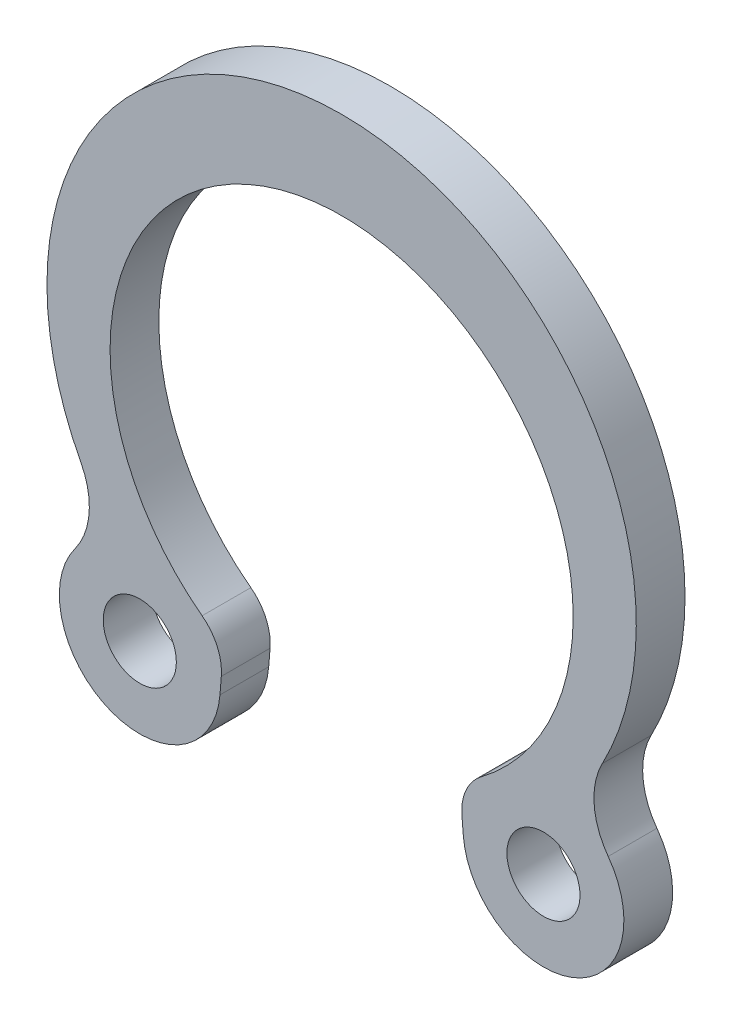
ISO-10303-21;
HEADER;
FILE_DESCRIPTION(('STEP AP214'),'2;1');
FILE_NAME('part.step','',(''),(''),'','','');
FILE_SCHEMA(('AUTOMOTIVE_DESIGN { 1 0 10303 214 1 1 1 1 }'));
ENDSEC;
DATA;
#1=APPLICATION_CONTEXT('core data for automotive mechanical design processes');
#2=APPLICATION_PROTOCOL_DEFINITION('international standard','automotive_design',2000,#1);
#3=PRODUCT_CONTEXT('',#1,'mechanical');
#4=PRODUCT('Part','Part','',(#3));
#5=PRODUCT_RELATED_PRODUCT_CATEGORY('part','',(#4));
#6=PRODUCT_DEFINITION_FORMATION('','',#4);
#7=PRODUCT_DEFINITION_CONTEXT('part definition',#1,'design');
#8=PRODUCT_DEFINITION('design','',#6,#7);
#9=PRODUCT_DEFINITION_SHAPE('','',#8);
#10=(LENGTH_UNIT() NAMED_UNIT(*) SI_UNIT(.MILLI.,.METRE.));
#11=(NAMED_UNIT(*) PLANE_ANGLE_UNIT() SI_UNIT($,.RADIAN.));
#12=(NAMED_UNIT(*) SI_UNIT($,.STERADIAN.) SOLID_ANGLE_UNIT());
#13=UNCERTAINTY_MEASURE_WITH_UNIT(LENGTH_MEASURE(1.E-05),#10,'distance_accuracy_value','');
#14=(GEOMETRIC_REPRESENTATION_CONTEXT(3) GLOBAL_UNCERTAINTY_ASSIGNED_CONTEXT((#13)) GLOBAL_UNIT_ASSIGNED_CONTEXT((#10,
#11,#12)) REPRESENTATION_CONTEXT('',''));
#15=CARTESIAN_POINT('',(0.,0.,0.));
#16=DIRECTION('',(0.,0.,1.));
#17=DIRECTION('',(1.,0.,0.));
#18=AXIS2_PLACEMENT_3D('',#15,#16,#17);
#19=CARTESIAN_POINT('',(0.,0.,1.));
#20=DIRECTION('',(0.,0.,1.));
#21=DIRECTION('',(1.,0.,0.));
#22=AXIS2_PLACEMENT_3D('',#19,#20,#21);
#23=PLANE('',#22);
#24=CARTESIAN_POINT('',(0.,0.,1.));
#25=DIRECTION('',(0.,0.,-1.));
#26=DIRECTION('',(1.,0.,0.));
#27=AXIS2_PLACEMENT_3D('',#24,#25,#26);
#28=CIRCLE('',#27,4.75);
#29=CARTESIAN_POINT('',(-2.86217284926524,-3.79083982528,1.));
#30=VERTEX_POINT('',#29);
#31=CARTESIAN_POINT('',(2.86217285222121,-3.79083982304818,1.));
#32=VERTEX_POINT('',#31);
#33=EDGE_CURVE('E127',#30,#32,#28,.T.);
#34=ORIENTED_EDGE('',*,*,#33,.T.);
#35=CARTESIAN_POINT('',(3.46473555795199,-4.58891136474253,1.));
#36=DIRECTION('',(0.,0.,-1.));
#37=DIRECTION('',(1.,7.79764165563523E-10,0.));
#38=AXIS2_PLACEMENT_3D('',#35,#36,#37);
#39=CIRCLE('',#38,1.);
#40=CARTESIAN_POINT('',(2.46804304489601,-4.67017657512285,1.));
#41=VERTEX_POINT('',#40);
#42=EDGE_CURVE('E152',#41,#32,#39,.T.);
#43=ORIENTED_EDGE('',*,*,#42,.F.);
#44=DIRECTION('',(-0.081265210380318,0.996692513055979,0.));
#45=VECTOR('',#44,1.);
#46=CARTESIAN_POINT('',(2.46804304489601,-4.67017657512285,1.));
#47=LINE('',#46,#45);
#48=CARTESIAN_POINT('',(2.49606525528703,-5.01386026418612,1.));
#49=VERTEX_POINT('',#48);
#50=EDGE_CURVE('E158',#49,#41,#47,.T.);
#51=ORIENTED_EDGE('',*,*,#50,.F.);
#52=CARTESIAN_POINT('',(4.14063276070596,-4.88007790316594,1.));
#53=DIRECTION('',(0.,0.,-1.));
#54=DIRECTION('',(-1.,-7.79764165563523E-10,0.));
#55=AXIS2_PLACEMENT_3D('',#52,#53,#54);
#56=CIRCLE('',#55,1.65);
#57=CARTESIAN_POINT('',(5.46837810565211,-3.9004900822056,1.));
#58=VERTEX_POINT('',#57);
#59=EDGE_CURVE('E198',#58,#49,#56,.T.);
#60=ORIENTED_EDGE('',*,*,#59,.F.);
#61=CARTESIAN_POINT('',(6.67541932833043,-3.00995569951438,1.));
#62=DIRECTION('',(0.,0.,1.));
#63=DIRECTION('',(-1.,-7.79764165563523E-10,0.));
#64=AXIS2_PLACEMENT_3D('',#61,#62,#63);
#65=CIRCLE('',#64,1.5);
#66=CARTESIAN_POINT('',(5.34821160235626,-2.31101389069588,1.));
#67=VERTEX_POINT('',#66);
#68=EDGE_CURVE('E200',#67,#58,#65,.T.);
#69=ORIENTED_EDGE('',*,*,#68,.F.);
#70=CARTESIAN_POINT('',(0.,0.505492235974415,1.));
#71=DIRECTION('',(0.,0.,1.));
#72=DIRECTION('',(1.,0.,0.));
#73=AXIS2_PLACEMENT_3D('',#70,#71,#72);
#74=CIRCLE('',#73,6.04450776402559);
#75=CARTESIAN_POINT('',(-5.34821160055421,-2.31101389486623,1.));
#76=VERTEX_POINT('',#75);
#77=EDGE_CURVE('E85',#67,#76,#74,.T.);
#78=ORIENTED_EDGE('',*,*,#77,.T.);
#79=CARTESIAN_POINT('',(-6.67541932598337,-3.00995570471963,1.));
#80=DIRECTION('',(0.,0.,-1.));
#81=DIRECTION('',(1.,0.,0.));
#82=AXIS2_PLACEMENT_3D('',#79,#80,#81);
#83=CIRCLE('',#82,1.5);
#84=CARTESIAN_POINT('',(-5.46837810261065,-3.90049008646964,1.));
#85=VERTEX_POINT('',#84);
#86=EDGE_CURVE('E99',#76,#85,#83,.T.);
#87=ORIENTED_EDGE('',*,*,#86,.T.);
#88=CARTESIAN_POINT('',(-4.14063275690066,-4.88007790639466,1.));
#89=DIRECTION('',(0.,0.,1.));
#90=DIRECTION('',(1.,0.,0.));
#91=AXIS2_PLACEMENT_3D('',#88,#89,#90);
#92=CIRCLE('',#91,1.65);
#93=CARTESIAN_POINT('',(-2.4960652513774,-5.01386026613247,1.));
#94=VERTEX_POINT('',#93);
#95=EDGE_CURVE('E93',#85,#94,#92,.T.);
#96=ORIENTED_EDGE('',*,*,#95,.T.);
#97=DIRECTION('',(0.0812652096031329,0.996692513119346,0.));
#98=VECTOR('',#97,1.);
#99=CARTESIAN_POINT('',(-2.46804304125437,-4.67017657704734,1.));
#100=LINE('',#99,#98);
#101=CARTESIAN_POINT('',(-2.46804304125437,-4.67017657704734,1.));
#102=VERTEX_POINT('',#101);
#103=EDGE_CURVE('E97',#94,#102,#100,.T.);
#104=ORIENTED_EDGE('',*,*,#103,.T.);
#105=CARTESIAN_POINT('',(-3.46473555437372,-4.58891136744421,1.));
#106=DIRECTION('',(0.,0.,1.));
#107=DIRECTION('',(-1.,0.,0.));
#108=AXIS2_PLACEMENT_3D('',#105,#106,#107);
#109=CIRCLE('',#108,1.);
#110=EDGE_CURVE('E50',#102,#30,#109,.T.);
#111=ORIENTED_EDGE('',*,*,#110,.T.);
#112=EDGE_LOOP('',(#34,#43,#51,#60,#69,#78,#87,#96,#104,#111));
#113=FACE_BOUND('',#112,.T.);
#114=CARTESIAN_POINT('',(-4.14063275690066,-4.88007790639466,1.));
#115=DIRECTION('',(0.,0.,1.));
#116=DIRECTION('',(1.,0.,0.));
#117=AXIS2_PLACEMENT_3D('',#114,#115,#116);
#118=CIRCLE('',#117,0.750000000000001);
#119=CARTESIAN_POINT('',(-3.39063275690065,-4.88007790639466,1.));
#120=VERTEX_POINT('',#119);
#121=EDGE_CURVE('E120',#120,#120,#118,.T.);
#122=ORIENTED_EDGE('',*,*,#121,.F.);
#123=EDGE_LOOP('',(#122));
#124=FACE_BOUND('',#123,.T.);
#125=CARTESIAN_POINT('',(4.14063276070596,-4.88007790316594,1.));
#126=DIRECTION('',(0.,0.,-1.));
#127=DIRECTION('',(-1.,-7.79764165563523E-10,0.));
#128=AXIS2_PLACEMENT_3D('',#125,#126,#127);
#129=CIRCLE('',#128,0.750000000000001);
#130=CARTESIAN_POINT('',(3.39063276070596,-4.88007790375076,1.));
#131=VERTEX_POINT('',#130);
#132=EDGE_CURVE('E208',#131,#131,#129,.T.);
#133=ORIENTED_EDGE('',*,*,#132,.T.);
#134=EDGE_LOOP('',(#133));
#135=FACE_BOUND('',#134,.T.);
#136=ADVANCED_FACE('F33',(#113,#124,#135),#23,.T.);
#137=CARTESIAN_POINT('',(0.,0.,0.));
#138=DIRECTION('',(0.,0.,1.));
#139=DIRECTION('',(1.,0.,0.));
#140=AXIS2_PLACEMENT_3D('',#137,#138,#139);
#141=PLANE('',#140);
#142=CARTESIAN_POINT('',(0.,0.,0.));
#143=DIRECTION('',(0.,0.,-1.));
#144=DIRECTION('',(1.,0.,0.));
#145=AXIS2_PLACEMENT_3D('',#142,#143,#144);
#146=CIRCLE('',#145,4.75);
#147=CARTESIAN_POINT('',(-2.86217284926524,-3.79083982528,0.));
#148=VERTEX_POINT('',#147);
#149=CARTESIAN_POINT('',(2.86217285222121,-3.79083982304818,0.));
#150=VERTEX_POINT('',#149);
#151=EDGE_CURVE('E116',#148,#150,#146,.T.);
#152=ORIENTED_EDGE('',*,*,#151,.F.);
#153=CARTESIAN_POINT('',(-3.46473555437372,-4.58891136744421,0.));
#154=DIRECTION('',(0.,0.,1.));
#155=DIRECTION('',(-1.,0.,0.));
#156=AXIS2_PLACEMENT_3D('',#153,#154,#155);
#157=CIRCLE('',#156,1.);
#158=CARTESIAN_POINT('',(-2.46804304125437,-4.67017657704734,0.));
#159=VERTEX_POINT('',#158);
#160=EDGE_CURVE('E77',#159,#148,#157,.T.);
#161=ORIENTED_EDGE('',*,*,#160,.F.);
#162=DIRECTION('',(0.0812652096031329,0.996692513119346,0.));
#163=VECTOR('',#162,1.);
#164=CARTESIAN_POINT('',(-2.46804304125437,-4.67017657704734,0.));
#165=LINE('',#164,#163);
#166=CARTESIAN_POINT('',(-2.4960652513774,-5.01386026613247,0.));
#167=VERTEX_POINT('',#166);
#168=EDGE_CURVE('E71',#167,#159,#165,.T.);
#169=ORIENTED_EDGE('',*,*,#168,.F.);
#170=CARTESIAN_POINT('',(-4.14063275690066,-4.88007790639466,0.));
#171=DIRECTION('',(0.,0.,1.));
#172=DIRECTION('',(1.,0.,0.));
#173=AXIS2_PLACEMENT_3D('',#170,#171,#172);
#174=CIRCLE('',#173,1.65);
#175=CARTESIAN_POINT('',(-5.46837810261065,-3.90049008646964,0.));
#176=VERTEX_POINT('',#175);
#177=EDGE_CURVE('E107',#176,#167,#174,.T.);
#178=ORIENTED_EDGE('',*,*,#177,.F.);
#179=CARTESIAN_POINT('',(-6.67541932598337,-3.00995570471963,0.));
#180=DIRECTION('',(0.,0.,-1.));
#181=DIRECTION('',(1.,0.,0.));
#182=AXIS2_PLACEMENT_3D('',#179,#180,#181);
#183=CIRCLE('',#182,1.5);
#184=CARTESIAN_POINT('',(-5.34821160055421,-2.31101389486623,0.));
#185=VERTEX_POINT('',#184);
#186=EDGE_CURVE('E122',#185,#176,#183,.T.);
#187=ORIENTED_EDGE('',*,*,#186,.F.);
#188=CARTESIAN_POINT('',(0.,0.505492235974415,0.));
#189=DIRECTION('',(0.,0.,1.));
#190=DIRECTION('',(1.,0.,0.));
#191=AXIS2_PLACEMENT_3D('',#188,#189,#190);
#192=CIRCLE('',#191,6.04450776402559);
#193=CARTESIAN_POINT('',(5.34821160235626,-2.31101389069588,0.));
#194=VERTEX_POINT('',#193);
#195=EDGE_CURVE('E119',#194,#185,#192,.T.);
#196=ORIENTED_EDGE('',*,*,#195,.F.);
#197=CARTESIAN_POINT('',(6.67541932833043,-3.00995569951438,0.));
#198=DIRECTION('',(0.,0.,1.));
#199=DIRECTION('',(-1.,-7.79764165563523E-10,0.));
#200=AXIS2_PLACEMENT_3D('',#197,#198,#199);
#201=CIRCLE('',#200,1.5);
#202=CARTESIAN_POINT('',(5.46837810565211,-3.9004900822056,0.));
#203=VERTEX_POINT('',#202);
#204=EDGE_CURVE('E204',#194,#203,#201,.T.);
#205=ORIENTED_EDGE('',*,*,#204,.T.);
#206=CARTESIAN_POINT('',(4.14063276070596,-4.88007790316594,0.));
#207=DIRECTION('',(0.,0.,-1.));
#208=DIRECTION('',(-1.,-7.79764165563523E-10,0.));
#209=AXIS2_PLACEMENT_3D('',#206,#207,#208);
#210=CIRCLE('',#209,1.65);
#211=CARTESIAN_POINT('',(2.49606525528703,-5.01386026418612,0.));
#212=VERTEX_POINT('',#211);
#213=EDGE_CURVE('E207',#203,#212,#210,.T.);
#214=ORIENTED_EDGE('',*,*,#213,.T.);
#215=DIRECTION('',(-0.081265210380318,0.996692513055979,0.));
#216=VECTOR('',#215,1.);
#217=CARTESIAN_POINT('',(2.46804304489601,-4.67017657512285,0.));
#218=LINE('',#217,#216);
#219=CARTESIAN_POINT('',(2.46804304489601,-4.67017657512285,0.));
#220=VERTEX_POINT('',#219);
#221=EDGE_CURVE('E194',#212,#220,#218,.T.);
#222=ORIENTED_EDGE('',*,*,#221,.T.);
#223=CARTESIAN_POINT('',(3.46473555795199,-4.58891136474253,0.));
#224=DIRECTION('',(0.,0.,-1.));
#225=DIRECTION('',(1.,7.79764165563523E-10,0.));
#226=AXIS2_PLACEMENT_3D('',#223,#224,#225);
#227=CIRCLE('',#226,1.);
#228=EDGE_CURVE('E139',#220,#150,#227,.T.);
#229=ORIENTED_EDGE('',*,*,#228,.T.);
#230=EDGE_LOOP('',(#152,#161,#169,#178,#187,#196,#205,#214,#222,#229));
#231=FACE_BOUND('',#230,.T.);
#232=CARTESIAN_POINT('',(-4.14063275690066,-4.88007790639466,0.));
#233=DIRECTION('',(0.,0.,1.));
#234=DIRECTION('',(1.,0.,0.));
#235=AXIS2_PLACEMENT_3D('',#232,#233,#234);
#236=CIRCLE('',#235,0.750000000000001);
#237=CARTESIAN_POINT('',(-3.39063275690065,-4.88007790639466,0.));
#238=VERTEX_POINT('',#237);
#239=EDGE_CURVE('E171',#238,#238,#236,.T.);
#240=ORIENTED_EDGE('',*,*,#239,.T.);
#241=EDGE_LOOP('',(#240));
#242=FACE_BOUND('',#241,.T.);
#243=CARTESIAN_POINT('',(4.14063276070596,-4.88007790316594,0.));
#244=DIRECTION('',(0.,0.,-1.));
#245=DIRECTION('',(-1.,-7.79764165563523E-10,0.));
#246=AXIS2_PLACEMENT_3D('',#243,#244,#245);
#247=CIRCLE('',#246,0.750000000000001);
#248=CARTESIAN_POINT('',(3.39063276070596,-4.88007790375076,0.));
#249=VERTEX_POINT('',#248);
#250=EDGE_CURVE('E214',#249,#249,#247,.T.);
#251=ORIENTED_EDGE('',*,*,#250,.F.);
#252=EDGE_LOOP('',(#251));
#253=FACE_BOUND('',#252,.T.);
#254=ADVANCED_FACE('F133',(#231,#242,#253),#141,.F.);
#255=CARTESIAN_POINT('',(0.,0.,1.));
#256=DIRECTION('',(0.,0.,-1.));
#257=DIRECTION('',(-1.,0.,0.));
#258=AXIS2_PLACEMENT_3D('',#255,#256,#257);
#259=CYLINDRICAL_SURFACE('',#258,4.75);
#260=ORIENTED_EDGE('',*,*,#151,.T.);
#261=DIRECTION('',(0.,0.,-1.));
#262=VECTOR('',#261,1.);
#263=CARTESIAN_POINT('',(2.86217285222121,-3.79083982304818,1.));
#264=LINE('',#263,#262);
#265=EDGE_CURVE('E144',#32,#150,#264,.T.);
#266=ORIENTED_EDGE('',*,*,#265,.F.);
#267=ORIENTED_EDGE('',*,*,#33,.F.);
#268=DIRECTION('',(0.,0.,-1.));
#269=VECTOR('',#268,1.);
#270=CARTESIAN_POINT('',(-2.86217284926524,-3.79083982528,1.));
#271=LINE('',#270,#269);
#272=EDGE_CURVE('E112',#30,#148,#271,.T.);
#273=ORIENTED_EDGE('',*,*,#272,.T.);
#274=EDGE_LOOP('',(#260,#266,#267,#273));
#275=FACE_BOUND('',#274,.T.);
#276=ADVANCED_FACE('F35',(#275),#259,.F.);
#277=CARTESIAN_POINT('',(0.,0.505492235974415,1.));
#278=DIRECTION('',(0.,0.,-1.));
#279=DIRECTION('',(-1.,0.,0.));
#280=AXIS2_PLACEMENT_3D('',#277,#278,#279);
#281=CYLINDRICAL_SURFACE('',#280,6.04450776402559);
#282=ORIENTED_EDGE('',*,*,#195,.T.);
#283=DIRECTION('',(0.,0.,-1.));
#284=VECTOR('',#283,1.);
#285=CARTESIAN_POINT('',(-5.34821160055421,-2.31101389486623,1.));
#286=LINE('',#285,#284);
#287=EDGE_CURVE('E11',#76,#185,#286,.T.);
#288=ORIENTED_EDGE('',*,*,#287,.F.);
#289=ORIENTED_EDGE('',*,*,#77,.F.);
#290=DIRECTION('',(0.,0.,-1.));
#291=VECTOR('',#290,1.);
#292=CARTESIAN_POINT('',(5.34821160235626,-2.31101389069588,1.));
#293=LINE('',#292,#291);
#294=EDGE_CURVE('E168',#67,#194,#293,.T.);
#295=ORIENTED_EDGE('',*,*,#294,.T.);
#296=EDGE_LOOP('',(#282,#288,#289,#295));
#297=FACE_BOUND('',#296,.T.);
#298=ADVANCED_FACE('F233',(#297),#281,.T.);
#299=CARTESIAN_POINT('',(-6.67541932598337,-3.00995570471963,1.));
#300=DIRECTION('',(0.,0.,-1.));
#301=DIRECTION('',(-1.,0.,0.));
#302=AXIS2_PLACEMENT_3D('',#299,#300,#301);
#303=CYLINDRICAL_SURFACE('',#302,1.5);
#304=ORIENTED_EDGE('',*,*,#186,.T.);
#305=DIRECTION('',(0.,0.,-1.));
#306=VECTOR('',#305,1.);
#307=CARTESIAN_POINT('',(-5.46837810261065,-3.90049008646964,1.));
#308=LINE('',#307,#306);
#309=EDGE_CURVE('E42',#85,#176,#308,.T.);
#310=ORIENTED_EDGE('',*,*,#309,.F.);
#311=ORIENTED_EDGE('',*,*,#86,.F.);
#312=ORIENTED_EDGE('',*,*,#287,.T.);
#313=EDGE_LOOP('',(#304,#310,#311,#312));
#314=FACE_BOUND('',#313,.T.);
#315=ADVANCED_FACE('F245',(#314),#303,.F.);
#316=CARTESIAN_POINT('',(-4.14063275690066,-4.88007790639466,1.));
#317=DIRECTION('',(0.,0.,-1.));
#318=DIRECTION('',(-1.,0.,0.));
#319=AXIS2_PLACEMENT_3D('',#316,#317,#318);
#320=CYLINDRICAL_SURFACE('',#319,1.65);
#321=ORIENTED_EDGE('',*,*,#177,.T.);
#322=DIRECTION('',(0.,0.,-1.));
#323=VECTOR('',#322,1.);
#324=CARTESIAN_POINT('',(-2.4960652513774,-5.01386026613247,1.));
#325=LINE('',#324,#323);
#326=EDGE_CURVE('E104',#94,#167,#325,.T.);
#327=ORIENTED_EDGE('',*,*,#326,.F.);
#328=ORIENTED_EDGE('',*,*,#95,.F.);
#329=ORIENTED_EDGE('',*,*,#309,.T.);
#330=EDGE_LOOP('',(#321,#327,#328,#329));
#331=FACE_BOUND('',#330,.T.);
#332=ADVANCED_FACE('F105',(#331),#320,.T.);
#333=CARTESIAN_POINT('',(-2.46804304125437,-4.67017657704734,1.));
#334=DIRECTION('',(-0.996692513119347,0.0812652096031329,0.));
#335=DIRECTION('',(-0.0812652096031329,-0.996692513119347,0.));
#336=AXIS2_PLACEMENT_3D('',#333,#334,#335);
#337=PLANE('',#336);
#338=ORIENTED_EDGE('',*,*,#168,.T.);
#339=DIRECTION('',(0.,0.,-1.));
#340=VECTOR('',#339,1.);
#341=CARTESIAN_POINT('',(-2.46804304125437,-4.67017657704734,1.));
#342=LINE('',#341,#340);
#343=EDGE_CURVE('E108',#102,#159,#342,.T.);
#344=ORIENTED_EDGE('',*,*,#343,.F.);
#345=ORIENTED_EDGE('',*,*,#103,.F.);
#346=ORIENTED_EDGE('',*,*,#326,.T.);
#347=EDGE_LOOP('',(#338,#344,#345,#346));
#348=FACE_BOUND('',#347,.T.);
#349=ADVANCED_FACE('F110',(#348),#337,.F.);
#350=CARTESIAN_POINT('',(-3.46473555437372,-4.58891136744421,1.));
#351=DIRECTION('',(0.,0.,-1.));
#352=DIRECTION('',(-1.,0.,0.));
#353=AXIS2_PLACEMENT_3D('',#350,#351,#352);
#354=CYLINDRICAL_SURFACE('',#353,1.);
#355=ORIENTED_EDGE('',*,*,#160,.T.);
#356=ORIENTED_EDGE('',*,*,#272,.F.);
#357=ORIENTED_EDGE('',*,*,#110,.F.);
#358=ORIENTED_EDGE('',*,*,#343,.T.);
#359=EDGE_LOOP('',(#355,#356,#357,#358));
#360=FACE_BOUND('',#359,.T.);
#361=ADVANCED_FACE('F237',(#360),#354,.T.);
#362=CARTESIAN_POINT('',(-4.14063275690066,-4.88007790639466,1.));
#363=DIRECTION('',(0.,0.,-1.));
#364=DIRECTION('',(-1.,0.,0.));
#365=AXIS2_PLACEMENT_3D('',#362,#363,#364);
#366=CYLINDRICAL_SURFACE('',#365,0.750000000000001);
#367=ORIENTED_EDGE('',*,*,#121,.T.);
#368=EDGE_LOOP('',(#367));
#369=FACE_BOUND('',#368,.T.);
#370=ORIENTED_EDGE('',*,*,#239,.F.);
#371=EDGE_LOOP('',(#370));
#372=FACE_BOUND('',#371,.T.);
#373=ADVANCED_FACE('F240',(#369,#372),#366,.F.);
#374=CARTESIAN_POINT('',(6.67541932833043,-3.00995569951438,1.));
#375=DIRECTION('',(0.,0.,-1.));
#376=DIRECTION('',(1.,7.79764165563523E-10,0.));
#377=AXIS2_PLACEMENT_3D('',#374,#375,#376);
#378=CYLINDRICAL_SURFACE('',#377,1.5);
#379=ORIENTED_EDGE('',*,*,#204,.F.);
#380=ORIENTED_EDGE('',*,*,#294,.F.);
#381=ORIENTED_EDGE('',*,*,#68,.T.);
#382=DIRECTION('',(0.,0.,-1.));
#383=VECTOR('',#382,1.);
#384=CARTESIAN_POINT('',(5.46837810565211,-3.9004900822056,1.));
#385=LINE('',#384,#383);
#386=EDGE_CURVE('E165',#58,#203,#385,.T.);
#387=ORIENTED_EDGE('',*,*,#386,.T.);
#388=EDGE_LOOP('',(#379,#380,#381,#387));
#389=FACE_BOUND('',#388,.T.);
#390=ADVANCED_FACE('F253',(#389),#378,.F.);
#391=CARTESIAN_POINT('',(4.14063276070596,-4.88007790316594,1.));
#392=DIRECTION('',(0.,0.,-1.));
#393=DIRECTION('',(1.,7.79764165563523E-10,0.));
#394=AXIS2_PLACEMENT_3D('',#391,#392,#393);
#395=CYLINDRICAL_SURFACE('',#394,1.65);
#396=ORIENTED_EDGE('',*,*,#213,.F.);
#397=ORIENTED_EDGE('',*,*,#386,.F.);
#398=ORIENTED_EDGE('',*,*,#59,.T.);
#399=DIRECTION('',(0.,0.,-1.));
#400=VECTOR('',#399,1.);
#401=CARTESIAN_POINT('',(2.49606525528703,-5.01386026418612,1.));
#402=LINE('',#401,#400);
#403=EDGE_CURVE('E156',#49,#212,#402,.T.);
#404=ORIENTED_EDGE('',*,*,#403,.T.);
#405=EDGE_LOOP('',(#396,#397,#398,#404));
#406=FACE_BOUND('',#405,.T.);
#407=ADVANCED_FACE('F256',(#406),#395,.T.);
#408=CARTESIAN_POINT('',(2.46804304489601,-4.67017657512285,1.));
#409=DIRECTION('',(0.996692513055979,0.081265210380318,0.));
#410=DIRECTION('',(0.081265210380318,-0.996692513055979,0.));
#411=AXIS2_PLACEMENT_3D('',#408,#409,#410);
#412=PLANE('',#411);
#413=ORIENTED_EDGE('',*,*,#221,.F.);
#414=ORIENTED_EDGE('',*,*,#403,.F.);
#415=ORIENTED_EDGE('',*,*,#50,.T.);
#416=DIRECTION('',(0.,0.,-1.));
#417=VECTOR('',#416,1.);
#418=CARTESIAN_POINT('',(2.46804304489601,-4.67017657512285,1.));
#419=LINE('',#418,#417);
#420=EDGE_CURVE('E153',#41,#220,#419,.T.);
#421=ORIENTED_EDGE('',*,*,#420,.T.);
#422=EDGE_LOOP('',(#413,#414,#415,#421));
#423=FACE_BOUND('',#422,.T.);
#424=ADVANCED_FACE('F192',(#423),#412,.F.);
#425=CARTESIAN_POINT('',(3.46473555795199,-4.58891136474253,1.));
#426=DIRECTION('',(0.,0.,-1.));
#427=DIRECTION('',(1.,7.79764165563523E-10,0.));
#428=AXIS2_PLACEMENT_3D('',#425,#426,#427);
#429=CYLINDRICAL_SURFACE('',#428,1.);
#430=ORIENTED_EDGE('',*,*,#228,.F.);
#431=ORIENTED_EDGE('',*,*,#420,.F.);
#432=ORIENTED_EDGE('',*,*,#42,.T.);
#433=ORIENTED_EDGE('',*,*,#265,.T.);
#434=EDGE_LOOP('',(#430,#431,#432,#433));
#435=FACE_BOUND('',#434,.T.);
#436=ADVANCED_FACE('F149',(#435),#429,.T.);
#437=CARTESIAN_POINT('',(4.14063276070596,-4.88007790316594,1.));
#438=DIRECTION('',(0.,0.,-1.));
#439=DIRECTION('',(1.,7.79764165563523E-10,0.));
#440=AXIS2_PLACEMENT_3D('',#437,#438,#439);
#441=CYLINDRICAL_SURFACE('',#440,0.750000000000001);
#442=ORIENTED_EDGE('',*,*,#132,.F.);
#443=EDGE_LOOP('',(#442));
#444=FACE_BOUND('',#443,.T.);
#445=ORIENTED_EDGE('',*,*,#250,.T.);
#446=EDGE_LOOP('',(#445));
#447=FACE_BOUND('',#446,.T.);
#448=ADVANCED_FACE('F221',(#444,#447),#441,.F.);
#449=CLOSED_SHELL('',(#136,#254,#276,#298,#315,#332,#349,#361,#373,#390,#407,#424,#436,#448));
#450=MANIFOLD_SOLID_BREP('B2',#449);
#451=ADVANCED_BREP_SHAPE_REPRESENTATION('',(#18,#450),#14);
#452=SHAPE_DEFINITION_REPRESENTATION(#9,#451);
ENDSEC;
END-ISO-10303-21;
